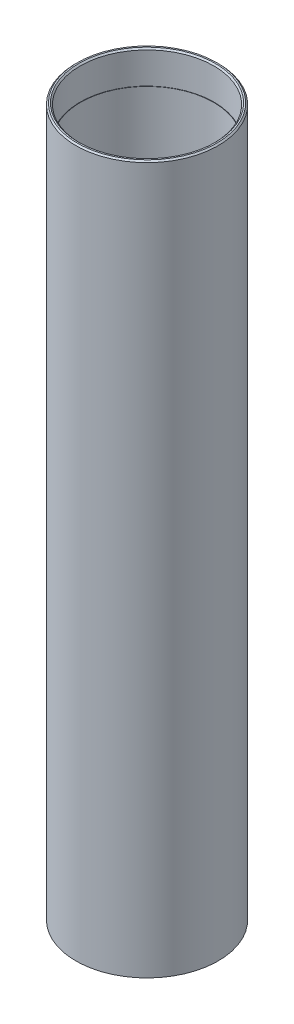
ISO-10303-21;
HEADER;
FILE_DESCRIPTION(('STEP AP214'),'2;1');
FILE_NAME('part.step','',(''),(''),'','','');
FILE_SCHEMA(('AUTOMOTIVE_DESIGN { 1 0 10303 214 1 1 1 1 }'));
ENDSEC;
DATA;
#1=APPLICATION_CONTEXT('core data for automotive mechanical design processes');
#2=APPLICATION_PROTOCOL_DEFINITION('international standard','automotive_design',2000,#1);
#3=PRODUCT_CONTEXT('',#1,'mechanical');
#4=PRODUCT('Part','Part','',(#3));
#5=PRODUCT_RELATED_PRODUCT_CATEGORY('part','',(#4));
#6=PRODUCT_DEFINITION_FORMATION('','',#4);
#7=PRODUCT_DEFINITION_CONTEXT('part definition',#1,'design');
#8=PRODUCT_DEFINITION('design','',#6,#7);
#9=PRODUCT_DEFINITION_SHAPE('','',#8);
#10=(LENGTH_UNIT() NAMED_UNIT(*) SI_UNIT(.MILLI.,.METRE.));
#11=(NAMED_UNIT(*) PLANE_ANGLE_UNIT() SI_UNIT($,.RADIAN.));
#12=(NAMED_UNIT(*) SI_UNIT($,.STERADIAN.) SOLID_ANGLE_UNIT());
#13=UNCERTAINTY_MEASURE_WITH_UNIT(LENGTH_MEASURE(1.E-05),#10,'distance_accuracy_value','');
#14=(GEOMETRIC_REPRESENTATION_CONTEXT(3) GLOBAL_UNCERTAINTY_ASSIGNED_CONTEXT((#13)) GLOBAL_UNIT_ASSIGNED_CONTEXT((#10,
#11,#12)) REPRESENTATION_CONTEXT('',''));
#15=CARTESIAN_POINT('',(0.,0.,0.));
#16=DIRECTION('',(0.,0.,1.));
#17=DIRECTION('',(1.,0.,0.));
#18=AXIS2_PLACEMENT_3D('',#15,#16,#17);
#19=CARTESIAN_POINT('',(0.,0.,0.));
#20=DIRECTION('',(0.,-1.,0.));
#21=DIRECTION('',(0.,0.,-1.));
#22=AXIS2_PLACEMENT_3D('',#19,#20,#21);
#23=CYLINDRICAL_SURFACE('',#22,11.938);
#24=CARTESIAN_POINT('',(0.,120.3706,0.));
#25=DIRECTION('',(0.,-1.,0.));
#26=DIRECTION('',(0.,0.,-1.));
#27=AXIS2_PLACEMENT_3D('',#24,#25,#26);
#28=CIRCLE('',#27,11.938);
#29=CARTESIAN_POINT('',(0.,120.3706,-11.938));
#30=VERTEX_POINT('',#29);
#31=EDGE_CURVE('E18',#30,#30,#28,.F.);
#32=ORIENTED_EDGE('',*,*,#31,.F.);
#33=EDGE_LOOP('',(#32));
#34=FACE_BOUND('',#33,.T.);
#35=CARTESIAN_POINT('',(0.,125.9586,0.));
#36=DIRECTION('',(0.,1.,0.));
#37=DIRECTION('',(0.,0.,1.));
#38=AXIS2_PLACEMENT_3D('',#35,#36,#37);
#39=CIRCLE('',#38,11.938);
#40=CARTESIAN_POINT('',(0.,125.9586,11.938));
#41=VERTEX_POINT('',#40);
#42=EDGE_CURVE('E31',#41,#41,#39,.T.);
#43=ORIENTED_EDGE('',*,*,#42,.T.);
#44=EDGE_LOOP('',(#43));
#45=FACE_BOUND('',#44,.T.);
#46=ADVANCED_FACE('F15',(#34,#45),#23,.F.);
#47=CARTESIAN_POINT('',(0.,126.2126,0.));
#48=DIRECTION('',(0.,1.,0.));
#49=DIRECTION('',(0.,0.,1.));
#50=AXIS2_PLACEMENT_3D('',#47,#48,#49);
#51=CONICAL_SURFACE('',#50,12.192,0.785398163397465);
#52=ORIENTED_EDGE('',*,*,#42,.F.);
#53=EDGE_LOOP('',(#52));
#54=FACE_BOUND('',#53,.T.);
#55=CARTESIAN_POINT('',(0.,126.2126,0.));
#56=DIRECTION('',(0.,1.,0.));
#57=DIRECTION('',(0.,0.,1.));
#58=AXIS2_PLACEMENT_3D('',#55,#56,#57);
#59=CIRCLE('',#58,12.192);
#60=CARTESIAN_POINT('',(0.,126.2126,12.192));
#61=VERTEX_POINT('',#60);
#62=EDGE_CURVE('E39',#61,#61,#59,.F.);
#63=ORIENTED_EDGE('',*,*,#62,.F.);
#64=EDGE_LOOP('',(#63));
#65=FACE_BOUND('',#64,.T.);
#66=ADVANCED_FACE('F50',(#54,#65),#51,.F.);
#67=CARTESIAN_POINT('',(11.938,120.3706,0.));
#68=DIRECTION('',(0.,1.,0.));
#69=DIRECTION('',(0.,0.,1.));
#70=AXIS2_PLACEMENT_3D('',#67,#68,#69);
#71=PLANE('',#70);
#72=ORIENTED_EDGE('',*,*,#31,.T.);
#73=EDGE_LOOP('',(#72));
#74=FACE_BOUND('',#73,.T.);
#75=CARTESIAN_POINT('',(0.,120.3706,0.));
#76=DIRECTION('',(0.,-1.,0.));
#77=DIRECTION('',(0.,0.,-1.));
#78=AXIS2_PLACEMENT_3D('',#75,#76,#77);
#79=CIRCLE('',#78,11.8745);
#80=CARTESIAN_POINT('',(0.,120.3706,-11.8745));
#81=VERTEX_POINT('',#80);
#82=EDGE_CURVE('E37',#81,#81,#79,.T.);
#83=ORIENTED_EDGE('',*,*,#82,.T.);
#84=EDGE_LOOP('',(#83));
#85=FACE_BOUND('',#84,.T.);
#86=ADVANCED_FACE('F53',(#74,#85),#71,.T.);
#87=CARTESIAN_POINT('',(12.7,126.2126,0.));
#88=DIRECTION('',(0.,1.,0.));
#89=DIRECTION('',(0.,0.,1.));
#90=AXIS2_PLACEMENT_3D('',#87,#88,#89);
#91=PLANE('',#90);
#92=CARTESIAN_POINT('',(0.,126.2126,0.));
#93=DIRECTION('',(0.,-1.,0.));
#94=DIRECTION('',(0.,0.,-1.));
#95=AXIS2_PLACEMENT_3D('',#92,#93,#94);
#96=CIRCLE('',#95,12.446);
#97=CARTESIAN_POINT('',(0.,126.2126,-12.446));
#98=VERTEX_POINT('',#97);
#99=EDGE_CURVE('E34',#98,#98,#96,.T.);
#100=ORIENTED_EDGE('',*,*,#99,.F.);
#101=EDGE_LOOP('',(#100));
#102=FACE_BOUND('',#101,.T.);
#103=ORIENTED_EDGE('',*,*,#62,.T.);
#104=EDGE_LOOP('',(#103));
#105=FACE_BOUND('',#104,.T.);
#106=ADVANCED_FACE('F59',(#102,#105),#91,.T.);
#107=CARTESIAN_POINT('',(0.,0.,0.));
#108=DIRECTION('',(0.,-1.,0.));
#109=DIRECTION('',(0.,0.,-1.));
#110=AXIS2_PLACEMENT_3D('',#107,#108,#109);
#111=CYLINDRICAL_SURFACE('',#110,11.8745);
#112=CARTESIAN_POINT('',(0.,0.,0.));
#113=DIRECTION('',(0.,-1.,0.));
#114=DIRECTION('',(0.,0.,-1.));
#115=AXIS2_PLACEMENT_3D('',#112,#113,#114);
#116=CIRCLE('',#115,11.8745);
#117=CARTESIAN_POINT('',(0.,0.,-11.8745));
#118=VERTEX_POINT('',#117);
#119=EDGE_CURVE('E27',#118,#118,#116,.F.);
#120=ORIENTED_EDGE('',*,*,#119,.F.);
#121=EDGE_LOOP('',(#120));
#122=FACE_BOUND('',#121,.T.);
#123=ORIENTED_EDGE('',*,*,#82,.F.);
#124=EDGE_LOOP('',(#123));
#125=FACE_BOUND('',#124,.T.);
#126=ADVANCED_FACE('F76',(#122,#125),#111,.F.);
#127=CARTESIAN_POINT('',(0.,125.9586,0.));
#128=DIRECTION('',(0.,-1.,0.));
#129=DIRECTION('',(0.,0.,-1.));
#130=AXIS2_PLACEMENT_3D('',#127,#128,#129);
#131=CONICAL_SURFACE('',#130,12.7,0.785398163397489);
#132=CARTESIAN_POINT('',(0.,125.9586,0.));
#133=DIRECTION('',(0.,-1.,0.));
#134=DIRECTION('',(0.,0.,-1.));
#135=AXIS2_PLACEMENT_3D('',#132,#133,#134);
#136=CIRCLE('',#135,12.7);
#137=CARTESIAN_POINT('',(0.,125.9586,-12.7));
#138=VERTEX_POINT('',#137);
#139=EDGE_CURVE('E22',#138,#138,#136,.T.);
#140=ORIENTED_EDGE('',*,*,#139,.F.);
#141=EDGE_LOOP('',(#140));
#142=FACE_BOUND('',#141,.T.);
#143=ORIENTED_EDGE('',*,*,#99,.T.);
#144=EDGE_LOOP('',(#143));
#145=FACE_BOUND('',#144,.T.);
#146=ADVANCED_FACE('F69',(#142,#145),#131,.T.);
#147=CARTESIAN_POINT('',(11.8745,0.,0.));
#148=DIRECTION('',(0.,-1.,0.));
#149=DIRECTION('',(0.,0.,-1.));
#150=AXIS2_PLACEMENT_3D('',#147,#148,#149);
#151=PLANE('',#150);
#152=ORIENTED_EDGE('',*,*,#119,.T.);
#153=EDGE_LOOP('',(#152));
#154=FACE_BOUND('',#153,.T.);
#155=CARTESIAN_POINT('',(0.,0.,0.));
#156=DIRECTION('',(0.,-1.,0.));
#157=DIRECTION('',(0.,0.,-1.));
#158=AXIS2_PLACEMENT_3D('',#155,#156,#157);
#159=CIRCLE('',#158,12.7);
#160=CARTESIAN_POINT('',(0.,0.,-12.7));
#161=VERTEX_POINT('',#160);
#162=EDGE_CURVE('E10',#161,#161,#159,.F.);
#163=ORIENTED_EDGE('',*,*,#162,.F.);
#164=EDGE_LOOP('',(#163));
#165=FACE_BOUND('',#164,.T.);
#166=ADVANCED_FACE('F64',(#154,#165),#151,.T.);
#167=CARTESIAN_POINT('',(0.,0.,0.));
#168=DIRECTION('',(0.,-1.,0.));
#169=DIRECTION('',(0.,0.,-1.));
#170=AXIS2_PLACEMENT_3D('',#167,#168,#169);
#171=CYLINDRICAL_SURFACE('',#170,12.7);
#172=ORIENTED_EDGE('',*,*,#162,.T.);
#173=EDGE_LOOP('',(#172));
#174=FACE_BOUND('',#173,.T.);
#175=ORIENTED_EDGE('',*,*,#139,.T.);
#176=EDGE_LOOP('',(#175));
#177=FACE_BOUND('',#176,.T.);
#178=ADVANCED_FACE('F62',(#174,#177),#171,.T.);
#179=CLOSED_SHELL('',(#46,#66,#86,#106,#126,#146,#166,#178));
#180=MANIFOLD_SOLID_BREP('B1',#179);
#181=ADVANCED_BREP_SHAPE_REPRESENTATION('',(#18,#180),#14);
#182=SHAPE_DEFINITION_REPRESENTATION(#9,#181);
ENDSEC;
END-ISO-10303-21;
